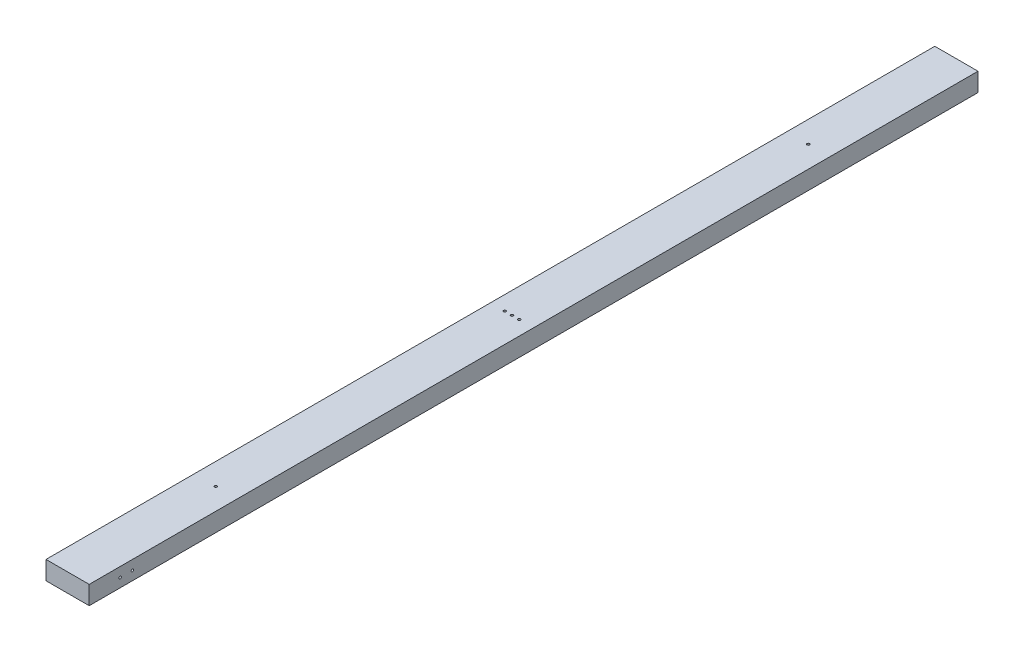
ISO-10303-21;
HEADER;
FILE_DESCRIPTION(('STEP AP214'),'2;1');
FILE_NAME('part.step','',(''),(''),'','','');
FILE_SCHEMA(('AUTOMOTIVE_DESIGN { 1 0 10303 214 1 1 1 1 }'));
ENDSEC;
DATA;
#1=APPLICATION_CONTEXT('core data for automotive mechanical design processes');
#2=APPLICATION_PROTOCOL_DEFINITION('international standard','automotive_design',2000,#1);
#3=PRODUCT_CONTEXT('',#1,'mechanical');
#4=PRODUCT('Part','Part','',(#3));
#5=PRODUCT_RELATED_PRODUCT_CATEGORY('part','',(#4));
#6=PRODUCT_DEFINITION_FORMATION('','',#4);
#7=PRODUCT_DEFINITION_CONTEXT('part definition',#1,'design');
#8=PRODUCT_DEFINITION('design','',#6,#7);
#9=PRODUCT_DEFINITION_SHAPE('','',#8);
#10=(LENGTH_UNIT() NAMED_UNIT(*) SI_UNIT(.MILLI.,.METRE.));
#11=(NAMED_UNIT(*) PLANE_ANGLE_UNIT() SI_UNIT($,.RADIAN.));
#12=(NAMED_UNIT(*) SI_UNIT($,.STERADIAN.) SOLID_ANGLE_UNIT());
#13=UNCERTAINTY_MEASURE_WITH_UNIT(LENGTH_MEASURE(1.E-05),#10,'distance_accuracy_value','');
#14=(GEOMETRIC_REPRESENTATION_CONTEXT(3) GLOBAL_UNCERTAINTY_ASSIGNED_CONTEXT((#13)) GLOBAL_UNIT_ASSIGNED_CONTEXT((#10,
#11,#12)) REPRESENTATION_CONTEXT('',''));
#15=CARTESIAN_POINT('',(0.,0.,0.));
#16=DIRECTION('',(0.,0.,1.));
#17=DIRECTION('',(1.,0.,0.));
#18=AXIS2_PLACEMENT_3D('',#15,#16,#17);
#19=CARTESIAN_POINT('',(-24.2291396594066,19.8033898305085,1828.8));
#20=DIRECTION('',(1.,0.,0.));
#21=DIRECTION('',(0.,0.,-1.));
#22=AXIS2_PLACEMENT_3D('',#19,#20,#21);
#23=PLANE('',#22);
#24=CARTESIAN_POINT('',(-24.2291396594066,0.,1739.9));
#25=DIRECTION('',(-1.,0.,0.));
#26=DIRECTION('',(0.,0.,1.));
#27=AXIS2_PLACEMENT_3D('',#24,#25,#26);
#28=CIRCLE('',#27,2.5796874999999);
#29=CARTESIAN_POINT('',(-24.2291396594066,0.,1742.4796875));
#30=VERTEX_POINT('',#29);
#31=EDGE_CURVE('E136',#30,#30,#28,.T.);
#32=ORIENTED_EDGE('',*,*,#31,.F.);
#33=EDGE_LOOP('',(#32));
#34=FACE_BOUND('',#33,.T.);
#35=CARTESIAN_POINT('',(-24.2291396594066,0.,1765.3));
#36=DIRECTION('',(-1.,0.,0.));
#37=DIRECTION('',(0.,0.,1.));
#38=AXIS2_PLACEMENT_3D('',#35,#36,#37);
#39=CIRCLE('',#38,2.5796874999999);
#40=CARTESIAN_POINT('',(-24.2291396594066,0.,1767.8796875));
#41=VERTEX_POINT('',#40);
#42=EDGE_CURVE('E127',#41,#41,#39,.T.);
#43=ORIENTED_EDGE('',*,*,#42,.F.);
#44=EDGE_LOOP('',(#43));
#45=FACE_BOUND('',#44,.T.);
#46=DIRECTION('',(0.,-1.,0.));
#47=VECTOR('',#46,1.);
#48=CARTESIAN_POINT('',(-24.2291396594066,19.8033898305085,0.));
#49=LINE('',#48,#47);
#50=CARTESIAN_POINT('',(-24.2291396594066,19.8033898305085,0.));
#51=VERTEX_POINT('',#50);
#52=CARTESIAN_POINT('',(-24.2291396594066,-18.2966101694915,0.));
#53=VERTEX_POINT('',#52);
#54=EDGE_CURVE('E106',#51,#53,#49,.T.);
#55=ORIENTED_EDGE('',*,*,#54,.T.);
#56=DIRECTION('',(0.,0.,-1.));
#57=VECTOR('',#56,1.);
#58=CARTESIAN_POINT('',(-24.2291396594066,-18.2966101694915,1828.8));
#59=LINE('',#58,#57);
#60=CARTESIAN_POINT('',(-24.2291396594066,-18.2966101694915,1828.8));
#61=VERTEX_POINT('',#60);
#62=EDGE_CURVE('E11',#61,#53,#59,.T.);
#63=ORIENTED_EDGE('',*,*,#62,.F.);
#64=DIRECTION('',(0.,-1.,0.));
#65=VECTOR('',#64,1.);
#66=CARTESIAN_POINT('',(-24.2291396594066,19.8033898305085,1828.8));
#67=LINE('',#66,#65);
#68=CARTESIAN_POINT('',(-24.2291396594066,19.8033898305085,1828.8));
#69=VERTEX_POINT('',#68);
#70=EDGE_CURVE('E90',#69,#61,#67,.T.);
#71=ORIENTED_EDGE('',*,*,#70,.F.);
#72=DIRECTION('',(0.,0.,-1.));
#73=VECTOR('',#72,1.);
#74=CARTESIAN_POINT('',(-24.2291396594066,19.8033898305085,1828.8));
#75=LINE('',#74,#73);
#76=EDGE_CURVE('E102',#69,#51,#75,.T.);
#77=ORIENTED_EDGE('',*,*,#76,.T.);
#78=EDGE_LOOP('',(#55,#63,#71,#77));
#79=FACE_BOUND('',#78,.T.);
#80=ADVANCED_FACE('F38',(#34,#45,#79),#23,.F.);
#81=CARTESIAN_POINT('',(-24.2291396594066,-18.2966101694915,1828.8));
#82=DIRECTION('',(0.,1.,0.));
#83=DIRECTION('',(0.,0.,1.));
#84=AXIS2_PLACEMENT_3D('',#81,#82,#83);
#85=PLANE('',#84);
#86=CARTESIAN_POINT('',(20.2208603405934,-18.2966101694915,1524.));
#87=DIRECTION('',(0.,-1.,0.));
#88=DIRECTION('',(0.,0.,-1.));
#89=AXIS2_PLACEMENT_3D('',#86,#87,#88);
#90=CIRCLE('',#89,2.5796875);
#91=CARTESIAN_POINT('',(20.2208603405934,-18.2966101694915,1521.4203125));
#92=VERTEX_POINT('',#91);
#93=EDGE_CURVE('E175',#92,#92,#90,.T.);
#94=ORIENTED_EDGE('',*,*,#93,.F.);
#95=EDGE_LOOP('',(#94));
#96=FACE_BOUND('',#95,.T.);
#97=CARTESIAN_POINT('',(20.2208603405934,-18.2966101694915,914.4));
#98=DIRECTION('',(0.,-1.,0.));
#99=DIRECTION('',(0.,0.,-1.));
#100=AXIS2_PLACEMENT_3D('',#97,#98,#99);
#101=CIRCLE('',#100,2.5796875);
#102=CARTESIAN_POINT('',(20.2208603405934,-18.2966101694915,911.8203125));
#103=VERTEX_POINT('',#102);
#104=EDGE_CURVE('E167',#103,#103,#101,.T.);
#105=ORIENTED_EDGE('',*,*,#104,.F.);
#106=EDGE_LOOP('',(#105));
#107=FACE_BOUND('',#106,.T.);
#108=CARTESIAN_POINT('',(20.2208603405934,-18.2966101694915,304.8));
#109=DIRECTION('',(0.,-1.,0.));
#110=DIRECTION('',(0.,0.,-1.));
#111=AXIS2_PLACEMENT_3D('',#108,#109,#110);
#112=CIRCLE('',#111,2.57968749999999);
#113=CARTESIAN_POINT('',(20.2208603405934,-18.2966101694915,302.2203125));
#114=VERTEX_POINT('',#113);
#115=EDGE_CURVE('E159',#114,#114,#112,.T.);
#116=ORIENTED_EDGE('',*,*,#115,.F.);
#117=EDGE_LOOP('',(#116));
#118=FACE_BOUND('',#117,.T.);
#119=CARTESIAN_POINT('',(35.0375270072601,-18.2966101694915,914.4));
#120=DIRECTION('',(0.,-1.,0.));
#121=DIRECTION('',(0.,0.,-1.));
#122=AXIS2_PLACEMENT_3D('',#119,#120,#121);
#123=CIRCLE('',#122,2.57968749999999);
#124=CARTESIAN_POINT('',(35.0375270072601,-18.2966101694915,911.8203125));
#125=VERTEX_POINT('',#124);
#126=EDGE_CURVE('E152',#125,#125,#123,.T.);
#127=ORIENTED_EDGE('',*,*,#126,.F.);
#128=EDGE_LOOP('',(#127));
#129=FACE_BOUND('',#128,.T.);
#130=CARTESIAN_POINT('',(5.40419367392677,-18.2966101694915,914.4));
#131=DIRECTION('',(0.,-1.,0.));
#132=DIRECTION('',(0.,0.,-1.));
#133=AXIS2_PLACEMENT_3D('',#130,#131,#132);
#134=CIRCLE('',#133,2.5796875);
#135=CARTESIAN_POINT('',(5.40419367392677,-18.2966101694915,911.8203125));
#136=VERTEX_POINT('',#135);
#137=EDGE_CURVE('E143',#136,#136,#134,.T.);
#138=ORIENTED_EDGE('',*,*,#137,.F.);
#139=EDGE_LOOP('',(#138));
#140=FACE_BOUND('',#139,.T.);
#141=DIRECTION('',(1.,0.,0.));
#142=VECTOR('',#141,1.);
#143=CARTESIAN_POINT('',(-24.2291396594066,-18.2966101694915,0.));
#144=LINE('',#143,#142);
#145=CARTESIAN_POINT('',(64.6708603405934,-18.2966101694915,0.));
#146=VERTEX_POINT('',#145);
#147=EDGE_CURVE('E95',#53,#146,#144,.T.);
#148=ORIENTED_EDGE('',*,*,#147,.T.);
#149=DIRECTION('',(0.,0.,-1.));
#150=VECTOR('',#149,1.);
#151=CARTESIAN_POINT('',(64.6708603405934,-18.2966101694915,1828.8));
#152=LINE('',#151,#150);
#153=CARTESIAN_POINT('',(64.6708603405934,-18.2966101694915,1828.8));
#154=VERTEX_POINT('',#153);
#155=EDGE_CURVE('E47',#154,#146,#152,.T.);
#156=ORIENTED_EDGE('',*,*,#155,.F.);
#157=DIRECTION('',(1.,0.,0.));
#158=VECTOR('',#157,1.);
#159=CARTESIAN_POINT('',(-24.2291396594066,-18.2966101694915,1828.8));
#160=LINE('',#159,#158);
#161=EDGE_CURVE('E85',#61,#154,#160,.T.);
#162=ORIENTED_EDGE('',*,*,#161,.F.);
#163=ORIENTED_EDGE('',*,*,#62,.T.);
#164=EDGE_LOOP('',(#148,#156,#162,#163));
#165=FACE_BOUND('',#164,.T.);
#166=ADVANCED_FACE('F94',(#96,#107,#118,#129,#140,#165),#85,.F.);
#167=CARTESIAN_POINT('',(64.6708603405934,19.8033898305085,1828.8));
#168=DIRECTION('',(-1.,0.,0.));
#169=DIRECTION('',(0.,0.,1.));
#170=AXIS2_PLACEMENT_3D('',#167,#168,#169);
#171=PLANE('',#170);
#172=CARTESIAN_POINT('',(64.6708603405934,0.,1739.9));
#173=DIRECTION('',(-1.,0.,0.));
#174=DIRECTION('',(0.,0.,1.));
#175=AXIS2_PLACEMENT_3D('',#172,#173,#174);
#176=CIRCLE('',#175,2.5796874999999);
#177=CARTESIAN_POINT('',(64.6708603405934,0.,1742.4796875));
#178=VERTEX_POINT('',#177);
#179=EDGE_CURVE('E110',#178,#178,#176,.T.);
#180=ORIENTED_EDGE('',*,*,#179,.T.);
#181=EDGE_LOOP('',(#180));
#182=FACE_BOUND('',#181,.T.);
#183=CARTESIAN_POINT('',(64.6708603405934,0.,1765.3));
#184=DIRECTION('',(-1.,0.,0.));
#185=DIRECTION('',(0.,0.,1.));
#186=AXIS2_PLACEMENT_3D('',#183,#184,#185);
#187=CIRCLE('',#186,2.5796874999999);
#188=CARTESIAN_POINT('',(64.6708603405934,0.,1767.8796875));
#189=VERTEX_POINT('',#188);
#190=EDGE_CURVE('E131',#189,#189,#187,.T.);
#191=ORIENTED_EDGE('',*,*,#190,.T.);
#192=EDGE_LOOP('',(#191));
#193=FACE_BOUND('',#192,.T.);
#194=DIRECTION('',(0.,1.,0.));
#195=VECTOR('',#194,1.);
#196=CARTESIAN_POINT('',(64.6708603405934,19.8033898305085,0.));
#197=LINE('',#196,#195);
#198=CARTESIAN_POINT('',(64.6708603405934,19.8033898305085,0.));
#199=VERTEX_POINT('',#198);
#200=EDGE_CURVE('E72',#146,#199,#197,.T.);
#201=ORIENTED_EDGE('',*,*,#200,.T.);
#202=DIRECTION('',(0.,0.,-1.));
#203=VECTOR('',#202,1.);
#204=CARTESIAN_POINT('',(64.6708603405934,19.8033898305085,1828.8));
#205=LINE('',#204,#203);
#206=CARTESIAN_POINT('',(64.6708603405934,19.8033898305085,1828.8));
#207=VERTEX_POINT('',#206);
#208=EDGE_CURVE('E97',#207,#199,#205,.T.);
#209=ORIENTED_EDGE('',*,*,#208,.F.);
#210=DIRECTION('',(0.,1.,0.));
#211=VECTOR('',#210,1.);
#212=CARTESIAN_POINT('',(64.6708603405934,19.8033898305085,1828.8));
#213=LINE('',#212,#211);
#214=EDGE_CURVE('E88',#154,#207,#213,.T.);
#215=ORIENTED_EDGE('',*,*,#214,.F.);
#216=ORIENTED_EDGE('',*,*,#155,.T.);
#217=EDGE_LOOP('',(#201,#209,#215,#216));
#218=FACE_BOUND('',#217,.T.);
#219=ADVANCED_FACE('F98',(#182,#193,#218),#171,.F.);
#220=CARTESIAN_POINT('',(-24.2291396594066,19.8033898305085,1828.8));
#221=DIRECTION('',(0.,-1.,0.));
#222=DIRECTION('',(0.,0.,-1.));
#223=AXIS2_PLACEMENT_3D('',#220,#221,#222);
#224=PLANE('',#223);
#225=CARTESIAN_POINT('',(20.2208603405934,19.8033898305085,1524.));
#226=DIRECTION('',(0.,-1.,0.));
#227=DIRECTION('',(0.,0.,-1.));
#228=AXIS2_PLACEMENT_3D('',#225,#226,#227);
#229=CIRCLE('',#228,2.5796875);
#230=CARTESIAN_POINT('',(20.2208603405934,19.8033898305085,1521.4203125));
#231=VERTEX_POINT('',#230);
#232=EDGE_CURVE('E148',#231,#231,#229,.T.);
#233=ORIENTED_EDGE('',*,*,#232,.T.);
#234=EDGE_LOOP('',(#233));
#235=FACE_BOUND('',#234,.T.);
#236=CARTESIAN_POINT('',(20.2208603405934,19.8033898305085,914.4));
#237=DIRECTION('',(0.,-1.,0.));
#238=DIRECTION('',(0.,0.,-1.));
#239=AXIS2_PLACEMENT_3D('',#236,#237,#238);
#240=CIRCLE('',#239,2.5796875);
#241=CARTESIAN_POINT('',(20.2208603405934,19.8033898305085,911.8203125));
#242=VERTEX_POINT('',#241);
#243=EDGE_CURVE('E171',#242,#242,#240,.T.);
#244=ORIENTED_EDGE('',*,*,#243,.T.);
#245=EDGE_LOOP('',(#244));
#246=FACE_BOUND('',#245,.T.);
#247=CARTESIAN_POINT('',(20.2208603405934,19.8033898305085,304.8));
#248=DIRECTION('',(0.,-1.,0.));
#249=DIRECTION('',(0.,0.,-1.));
#250=AXIS2_PLACEMENT_3D('',#247,#248,#249);
#251=CIRCLE('',#250,2.57968749999999);
#252=CARTESIAN_POINT('',(20.2208603405934,19.8033898305085,302.2203125));
#253=VERTEX_POINT('',#252);
#254=EDGE_CURVE('E163',#253,#253,#251,.T.);
#255=ORIENTED_EDGE('',*,*,#254,.T.);
#256=EDGE_LOOP('',(#255));
#257=FACE_BOUND('',#256,.T.);
#258=CARTESIAN_POINT('',(35.0375270072601,19.8033898305085,914.4));
#259=DIRECTION('',(0.,-1.,0.));
#260=DIRECTION('',(0.,0.,-1.));
#261=AXIS2_PLACEMENT_3D('',#258,#259,#260);
#262=CIRCLE('',#261,2.57968749999999);
#263=CARTESIAN_POINT('',(35.0375270072601,19.8033898305085,911.8203125));
#264=VERTEX_POINT('',#263);
#265=EDGE_CURVE('E132',#264,#264,#262,.T.);
#266=ORIENTED_EDGE('',*,*,#265,.T.);
#267=EDGE_LOOP('',(#266));
#268=FACE_BOUND('',#267,.T.);
#269=CARTESIAN_POINT('',(5.40419367392677,19.8033898305085,914.4));
#270=DIRECTION('',(0.,-1.,0.));
#271=DIRECTION('',(0.,0.,-1.));
#272=AXIS2_PLACEMENT_3D('',#269,#270,#271);
#273=CIRCLE('',#272,2.5796875);
#274=CARTESIAN_POINT('',(5.40419367392677,19.8033898305085,911.8203125));
#275=VERTEX_POINT('',#274);
#276=EDGE_CURVE('E147',#275,#275,#273,.T.);
#277=ORIENTED_EDGE('',*,*,#276,.T.);
#278=EDGE_LOOP('',(#277));
#279=FACE_BOUND('',#278,.T.);
#280=DIRECTION('',(-1.,0.,0.));
#281=VECTOR('',#280,1.);
#282=CARTESIAN_POINT('',(-24.2291396594066,19.8033898305085,0.));
#283=LINE('',#282,#281);
#284=EDGE_CURVE('E78',#199,#51,#283,.T.);
#285=ORIENTED_EDGE('',*,*,#284,.T.);
#286=ORIENTED_EDGE('',*,*,#76,.F.);
#287=DIRECTION('',(-1.,0.,0.));
#288=VECTOR('',#287,1.);
#289=CARTESIAN_POINT('',(-24.2291396594066,19.8033898305085,1828.8));
#290=LINE('',#289,#288);
#291=EDGE_CURVE('E55',#207,#69,#290,.T.);
#292=ORIENTED_EDGE('',*,*,#291,.F.);
#293=ORIENTED_EDGE('',*,*,#208,.T.);
#294=EDGE_LOOP('',(#285,#286,#292,#293));
#295=FACE_BOUND('',#294,.T.);
#296=ADVANCED_FACE('F120',(#235,#246,#257,#268,#279,#295),#224,.F.);
#297=CARTESIAN_POINT('',(0.,0.,1828.8));
#298=DIRECTION('',(0.,0.,1.));
#299=DIRECTION('',(1.,0.,0.));
#300=AXIS2_PLACEMENT_3D('',#297,#298,#299);
#301=PLANE('',#300);
#302=ORIENTED_EDGE('',*,*,#70,.T.);
#303=ORIENTED_EDGE('',*,*,#161,.T.);
#304=ORIENTED_EDGE('',*,*,#214,.T.);
#305=ORIENTED_EDGE('',*,*,#291,.T.);
#306=EDGE_LOOP('',(#302,#303,#304,#305));
#307=FACE_BOUND('',#306,.T.);
#308=ADVANCED_FACE('F86',(#307),#301,.T.);
#309=CARTESIAN_POINT('',(0.,0.,0.));
#310=DIRECTION('',(0.,0.,1.));
#311=DIRECTION('',(1.,0.,0.));
#312=AXIS2_PLACEMENT_3D('',#309,#310,#311);
#313=PLANE('',#312);
#314=ORIENTED_EDGE('',*,*,#54,.F.);
#315=ORIENTED_EDGE('',*,*,#284,.F.);
#316=ORIENTED_EDGE('',*,*,#200,.F.);
#317=ORIENTED_EDGE('',*,*,#147,.F.);
#318=EDGE_LOOP('',(#314,#315,#316,#317));
#319=FACE_BOUND('',#318,.T.);
#320=ADVANCED_FACE('F123',(#319),#313,.F.);
#321=CARTESIAN_POINT('',(64.6708603405934,0.,1765.3));
#322=DIRECTION('',(-1.,0.,0.));
#323=DIRECTION('',(0.,0.,1.));
#324=AXIS2_PLACEMENT_3D('',#321,#322,#323);
#325=CYLINDRICAL_SURFACE('',#324,2.5796874999999);
#326=ORIENTED_EDGE('',*,*,#190,.F.);
#327=EDGE_LOOP('',(#326));
#328=FACE_BOUND('',#327,.T.);
#329=ORIENTED_EDGE('',*,*,#42,.T.);
#330=EDGE_LOOP('',(#329));
#331=FACE_BOUND('',#330,.T.);
#332=ADVANCED_FACE('F215',(#328,#331),#325,.F.);
#333=CARTESIAN_POINT('',(64.6708603405934,0.,1739.9));
#334=DIRECTION('',(-1.,0.,0.));
#335=DIRECTION('',(0.,0.,1.));
#336=AXIS2_PLACEMENT_3D('',#333,#334,#335);
#337=CYLINDRICAL_SURFACE('',#336,2.5796874999999);
#338=ORIENTED_EDGE('',*,*,#179,.F.);
#339=EDGE_LOOP('',(#338));
#340=FACE_BOUND('',#339,.T.);
#341=ORIENTED_EDGE('',*,*,#31,.T.);
#342=EDGE_LOOP('',(#341));
#343=FACE_BOUND('',#342,.T.);
#344=ADVANCED_FACE('F205',(#340,#343),#337,.F.);
#345=CARTESIAN_POINT('',(5.40419367392677,19.8033898305085,914.4));
#346=DIRECTION('',(0.,-1.,0.));
#347=DIRECTION('',(0.,0.,-1.));
#348=AXIS2_PLACEMENT_3D('',#345,#346,#347);
#349=CYLINDRICAL_SURFACE('',#348,2.5796875);
#350=ORIENTED_EDGE('',*,*,#276,.F.);
#351=EDGE_LOOP('',(#350));
#352=FACE_BOUND('',#351,.T.);
#353=ORIENTED_EDGE('',*,*,#137,.T.);
#354=EDGE_LOOP('',(#353));
#355=FACE_BOUND('',#354,.T.);
#356=ADVANCED_FACE('F202',(#352,#355),#349,.F.);
#357=CARTESIAN_POINT('',(35.0375270072601,19.8033898305085,914.4));
#358=DIRECTION('',(0.,-1.,0.));
#359=DIRECTION('',(0.,0.,-1.));
#360=AXIS2_PLACEMENT_3D('',#357,#358,#359);
#361=CYLINDRICAL_SURFACE('',#360,2.57968749999999);
#362=ORIENTED_EDGE('',*,*,#265,.F.);
#363=EDGE_LOOP('',(#362));
#364=FACE_BOUND('',#363,.T.);
#365=ORIENTED_EDGE('',*,*,#126,.T.);
#366=EDGE_LOOP('',(#365));
#367=FACE_BOUND('',#366,.T.);
#368=ADVANCED_FACE('F204',(#364,#367),#361,.F.);
#369=CARTESIAN_POINT('',(20.2208603405934,19.8033898305085,304.8));
#370=DIRECTION('',(0.,-1.,0.));
#371=DIRECTION('',(0.,0.,-1.));
#372=AXIS2_PLACEMENT_3D('',#369,#370,#371);
#373=CYLINDRICAL_SURFACE('',#372,2.57968749999999);
#374=ORIENTED_EDGE('',*,*,#254,.F.);
#375=EDGE_LOOP('',(#374));
#376=FACE_BOUND('',#375,.T.);
#377=ORIENTED_EDGE('',*,*,#115,.T.);
#378=EDGE_LOOP('',(#377));
#379=FACE_BOUND('',#378,.T.);
#380=ADVANCED_FACE('F212',(#376,#379),#373,.F.);
#381=CARTESIAN_POINT('',(20.2208603405934,19.8033898305085,914.4));
#382=DIRECTION('',(0.,-1.,0.));
#383=DIRECTION('',(0.,0.,-1.));
#384=AXIS2_PLACEMENT_3D('',#381,#382,#383);
#385=CYLINDRICAL_SURFACE('',#384,2.5796875);
#386=ORIENTED_EDGE('',*,*,#243,.F.);
#387=EDGE_LOOP('',(#386));
#388=FACE_BOUND('',#387,.T.);
#389=ORIENTED_EDGE('',*,*,#104,.T.);
#390=EDGE_LOOP('',(#389));
#391=FACE_BOUND('',#390,.T.);
#392=ADVANCED_FACE('F188',(#388,#391),#385,.F.);
#393=CARTESIAN_POINT('',(20.2208603405934,19.8033898305085,1524.));
#394=DIRECTION('',(0.,-1.,0.));
#395=DIRECTION('',(0.,0.,-1.));
#396=AXIS2_PLACEMENT_3D('',#393,#394,#395);
#397=CYLINDRICAL_SURFACE('',#396,2.5796875);
#398=ORIENTED_EDGE('',*,*,#232,.F.);
#399=EDGE_LOOP('',(#398));
#400=FACE_BOUND('',#399,.T.);
#401=ORIENTED_EDGE('',*,*,#93,.T.);
#402=EDGE_LOOP('',(#401));
#403=FACE_BOUND('',#402,.T.);
#404=ADVANCED_FACE('F185',(#400,#403),#397,.F.);
#405=CLOSED_SHELL('',(#80,#166,#219,#296,#308,#320,#332,#344,#356,#368,#380,#392,#404));
#406=MANIFOLD_SOLID_BREP('B2',#405);
#407=ADVANCED_BREP_SHAPE_REPRESENTATION('',(#18,#406),#14);
#408=SHAPE_DEFINITION_REPRESENTATION(#9,#407);
ENDSEC;
END-ISO-10303-21;
